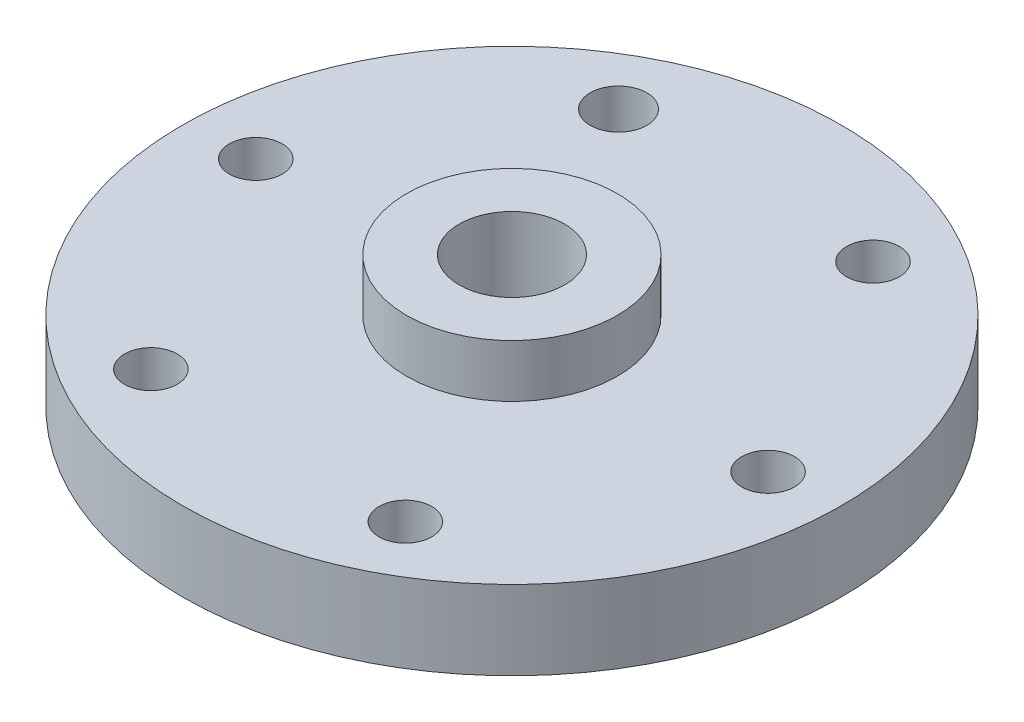
ISO-10303-21;
HEADER;
FILE_DESCRIPTION(('STEP AP214'),'2;1');
FILE_NAME('part.step','',(''),(''),'','','');
FILE_SCHEMA(('AUTOMOTIVE_DESIGN { 1 0 10303 214 1 1 1 1 }'));
ENDSEC;
DATA;
#1=APPLICATION_CONTEXT('core data for automotive mechanical design processes');
#2=APPLICATION_PROTOCOL_DEFINITION('international standard','automotive_design',2000,#1);
#3=PRODUCT_CONTEXT('',#1,'mechanical');
#4=PRODUCT('Part','Part','',(#3));
#5=PRODUCT_RELATED_PRODUCT_CATEGORY('part','',(#4));
#6=PRODUCT_DEFINITION_FORMATION('','',#4);
#7=PRODUCT_DEFINITION_CONTEXT('part definition',#1,'design');
#8=PRODUCT_DEFINITION('design','',#6,#7);
#9=PRODUCT_DEFINITION_SHAPE('','',#8);
#10=(LENGTH_UNIT() NAMED_UNIT(*) SI_UNIT(.MILLI.,.METRE.));
#11=(NAMED_UNIT(*) PLANE_ANGLE_UNIT() SI_UNIT($,.RADIAN.));
#12=(NAMED_UNIT(*) SI_UNIT($,.STERADIAN.) SOLID_ANGLE_UNIT());
#13=UNCERTAINTY_MEASURE_WITH_UNIT(LENGTH_MEASURE(1.E-05),#10,'distance_accuracy_value','');
#14=(GEOMETRIC_REPRESENTATION_CONTEXT(3) GLOBAL_UNCERTAINTY_ASSIGNED_CONTEXT((#13)) GLOBAL_UNIT_ASSIGNED_CONTEXT((#10,
#11,#12)) REPRESENTATION_CONTEXT('',''));
#15=CARTESIAN_POINT('',(0.,0.,0.));
#16=DIRECTION('',(0.,0.,1.));
#17=DIRECTION('',(1.,0.,0.));
#18=AXIS2_PLACEMENT_3D('',#15,#16,#17);
#19=CARTESIAN_POINT('',(0.,3.,0.));
#20=DIRECTION('',(0.,-1.,0.));
#21=DIRECTION('',(0.,0.,-1.));
#22=AXIS2_PLACEMENT_3D('',#19,#20,#21);
#23=CYLINDRICAL_SURFACE('',#22,12.5);
#24=CARTESIAN_POINT('',(0.,3.,0.));
#25=DIRECTION('',(0.,1.,0.));
#26=DIRECTION('',(0.,0.,1.));
#27=AXIS2_PLACEMENT_3D('',#24,#25,#26);
#28=CIRCLE('',#27,12.5);
#29=CARTESIAN_POINT('',(0.,3.,12.5));
#30=VERTEX_POINT('',#29);
#31=EDGE_CURVE('E10',#30,#30,#28,.T.);
#32=ORIENTED_EDGE('',*,*,#31,.F.);
#33=EDGE_LOOP('',(#32));
#34=FACE_BOUND('',#33,.T.);
#35=CARTESIAN_POINT('',(0.,0.,0.));
#36=DIRECTION('',(0.,1.,0.));
#37=DIRECTION('',(0.,0.,1.));
#38=AXIS2_PLACEMENT_3D('',#35,#36,#37);
#39=CIRCLE('',#38,12.5);
#40=CARTESIAN_POINT('',(0.,0.,12.5));
#41=VERTEX_POINT('',#40);
#42=EDGE_CURVE('E41',#41,#41,#39,.T.);
#43=ORIENTED_EDGE('',*,*,#42,.T.);
#44=EDGE_LOOP('',(#43));
#45=FACE_BOUND('',#44,.T.);
#46=ADVANCED_FACE('F34',(#34,#45),#23,.T.);
#47=CARTESIAN_POINT('',(0.,3.,0.));
#48=DIRECTION('',(0.,1.,0.));
#49=DIRECTION('',(0.,0.,1.));
#50=AXIS2_PLACEMENT_3D('',#47,#48,#49);
#51=PLANE('',#50);
#52=CARTESIAN_POINT('',(4.75488129081184,3.,8.79722137440491));
#53=DIRECTION('',(0.,1.,0.));
#54=DIRECTION('',(0.,0.,1.));
#55=AXIS2_PLACEMENT_3D('',#52,#53,#54);
#56=CIRCLE('',#55,1.);
#57=CARTESIAN_POINT('',(4.75488129081184,3.,9.7972213744049));
#58=VERTEX_POINT('',#57);
#59=EDGE_CURVE('E87',#58,#58,#56,.T.);
#60=ORIENTED_EDGE('',*,*,#59,.F.);
#61=EDGE_LOOP('',(#60));
#62=FACE_BOUND('',#61,.T.);
#63=CARTESIAN_POINT('',(9.99605783835602,3.,0.280762697380048));
#64=DIRECTION('',(0.,1.,0.));
#65=DIRECTION('',(0.,0.,1.));
#66=AXIS2_PLACEMENT_3D('',#63,#64,#65);
#67=CIRCLE('',#66,1.);
#68=CARTESIAN_POINT('',(9.99605783835602,3.,1.28076269738005));
#69=VERTEX_POINT('',#68);
#70=EDGE_CURVE('E84',#69,#69,#67,.T.);
#71=ORIENTED_EDGE('',*,*,#70,.F.);
#72=EDGE_LOOP('',(#71));
#73=FACE_BOUND('',#72,.T.);
#74=CARTESIAN_POINT('',(-4.75488129081184,3.,-8.79722137440491));
#75=DIRECTION('',(0.,1.,0.));
#76=DIRECTION('',(0.,0.,1.));
#77=AXIS2_PLACEMENT_3D('',#74,#75,#76);
#78=CIRCLE('',#77,1.07309001430205);
#79=CARTESIAN_POINT('',(-4.75488129081184,3.,-7.72413136010286));
#80=VERTEX_POINT('',#79);
#81=EDGE_CURVE('E78',#80,#80,#78,.T.);
#82=ORIENTED_EDGE('',*,*,#81,.F.);
#83=EDGE_LOOP('',(#82));
#84=FACE_BOUND('',#83,.T.);
#85=CARTESIAN_POINT('',(-9.99605783835603,3.,-0.280762697380052));
#86=DIRECTION('',(0.,1.,0.));
#87=DIRECTION('',(0.,0.,1.));
#88=AXIS2_PLACEMENT_3D('',#85,#86,#87);
#89=CIRCLE('',#88,1.);
#90=CARTESIAN_POINT('',(-9.99605783835603,3.,0.719237302619948));
#91=VERTEX_POINT('',#90);
#92=EDGE_CURVE('E72',#91,#91,#89,.T.);
#93=ORIENTED_EDGE('',*,*,#92,.F.);
#94=EDGE_LOOP('',(#93));
#95=FACE_BOUND('',#94,.T.);
#96=CARTESIAN_POINT('',(-5.08077042909345,3.,8.61334579076777));
#97=DIRECTION('',(0.,1.,0.));
#98=DIRECTION('',(0.,0.,1.));
#99=AXIS2_PLACEMENT_3D('',#96,#97,#98);
#100=CIRCLE('',#99,1.);
#101=CARTESIAN_POINT('',(-5.08077042909345,3.,9.61334579076777));
#102=VERTEX_POINT('',#101);
#103=EDGE_CURVE('E62',#102,#102,#100,.T.);
#104=ORIENTED_EDGE('',*,*,#103,.F.);
#105=EDGE_LOOP('',(#104));
#106=FACE_BOUND('',#105,.T.);
#107=CARTESIAN_POINT('',(5.08077042909345,3.,-8.61334579076778));
#108=DIRECTION('',(0.,1.,0.));
#109=DIRECTION('',(0.,0.,1.));
#110=AXIS2_PLACEMENT_3D('',#107,#108,#109);
#111=CIRCLE('',#110,1.00000000000076);
#112=CARTESIAN_POINT('',(5.08077042909345,3.,-7.61334579076701));
#113=VERTEX_POINT('',#112);
#114=EDGE_CURVE('E59',#113,#113,#111,.T.);
#115=ORIENTED_EDGE('',*,*,#114,.F.);
#116=EDGE_LOOP('',(#115));
#117=FACE_BOUND('',#116,.T.);
#118=CARTESIAN_POINT('',(0.,3.,0.));
#119=DIRECTION('',(0.,1.,0.));
#120=DIRECTION('',(0.,0.,1.));
#121=AXIS2_PLACEMENT_3D('',#118,#119,#120);
#122=CIRCLE('',#121,4.);
#123=CARTESIAN_POINT('',(0.,3.,4.));
#124=VERTEX_POINT('',#123);
#125=EDGE_CURVE('E46',#124,#124,#122,.F.);
#126=ORIENTED_EDGE('',*,*,#125,.T.);
#127=EDGE_LOOP('',(#126));
#128=FACE_BOUND('',#127,.T.);
#129=ORIENTED_EDGE('',*,*,#31,.T.);
#130=EDGE_LOOP('',(#129));
#131=FACE_BOUND('',#130,.T.);
#132=ADVANCED_FACE('F103',(#62,#73,#84,#95,#106,#117,#128,#131),#51,.T.);
#133=CARTESIAN_POINT('',(0.,0.,0.));
#134=DIRECTION('',(0.,1.,0.));
#135=DIRECTION('',(0.,0.,1.));
#136=AXIS2_PLACEMENT_3D('',#133,#134,#135);
#137=PLANE('',#136);
#138=CARTESIAN_POINT('',(4.75488129081184,0.,8.79722137440491));
#139=DIRECTION('',(0.,1.,0.));
#140=DIRECTION('',(0.,0.,1.));
#141=AXIS2_PLACEMENT_3D('',#138,#139,#140);
#142=CIRCLE('',#141,1.);
#143=CARTESIAN_POINT('',(4.75488129081184,0.,9.7972213744049));
#144=VERTEX_POINT('',#143);
#145=EDGE_CURVE('E66',#144,#144,#142,.T.);
#146=ORIENTED_EDGE('',*,*,#145,.T.);
#147=EDGE_LOOP('',(#146));
#148=FACE_BOUND('',#147,.T.);
#149=CARTESIAN_POINT('',(9.99605783835602,0.,0.280762697380048));
#150=DIRECTION('',(0.,1.,0.));
#151=DIRECTION('',(0.,0.,1.));
#152=AXIS2_PLACEMENT_3D('',#149,#150,#151);
#153=CIRCLE('',#152,1.);
#154=CARTESIAN_POINT('',(9.99605783835602,0.,1.28076269738005));
#155=VERTEX_POINT('',#154);
#156=EDGE_CURVE('E81',#155,#155,#153,.T.);
#157=ORIENTED_EDGE('',*,*,#156,.T.);
#158=EDGE_LOOP('',(#157));
#159=FACE_BOUND('',#158,.T.);
#160=CARTESIAN_POINT('',(-4.75488129081184,0.,-8.79722137440491));
#161=DIRECTION('',(0.,1.,0.));
#162=DIRECTION('',(0.,0.,1.));
#163=AXIS2_PLACEMENT_3D('',#160,#161,#162);
#164=CIRCLE('',#163,1.07309001430205);
#165=CARTESIAN_POINT('',(-4.75488129081184,0.,-7.72413136010286));
#166=VERTEX_POINT('',#165);
#167=EDGE_CURVE('E75',#166,#166,#164,.T.);
#168=ORIENTED_EDGE('',*,*,#167,.T.);
#169=EDGE_LOOP('',(#168));
#170=FACE_BOUND('',#169,.T.);
#171=CARTESIAN_POINT('',(-9.99605783835603,0.,-0.280762697380052));
#172=DIRECTION('',(0.,1.,0.));
#173=DIRECTION('',(0.,0.,1.));
#174=AXIS2_PLACEMENT_3D('',#171,#172,#173);
#175=CIRCLE('',#174,1.);
#176=CARTESIAN_POINT('',(-9.99605783835603,0.,0.719237302619948));
#177=VERTEX_POINT('',#176);
#178=EDGE_CURVE('E69',#177,#177,#175,.T.);
#179=ORIENTED_EDGE('',*,*,#178,.T.);
#180=EDGE_LOOP('',(#179));
#181=FACE_BOUND('',#180,.T.);
#182=CARTESIAN_POINT('',(-5.08077042909345,0.,8.61334579076777));
#183=DIRECTION('',(0.,1.,0.));
#184=DIRECTION('',(0.,0.,1.));
#185=AXIS2_PLACEMENT_3D('',#182,#183,#184);
#186=CIRCLE('',#185,1.);
#187=CARTESIAN_POINT('',(-5.08077042909345,0.,9.61334579076777));
#188=VERTEX_POINT('',#187);
#189=EDGE_CURVE('E63',#188,#188,#186,.T.);
#190=ORIENTED_EDGE('',*,*,#189,.T.);
#191=EDGE_LOOP('',(#190));
#192=FACE_BOUND('',#191,.T.);
#193=CARTESIAN_POINT('',(5.08077042909345,0.,-8.61334579076778));
#194=DIRECTION('',(0.,1.,0.));
#195=DIRECTION('',(0.,0.,1.));
#196=AXIS2_PLACEMENT_3D('',#193,#194,#195);
#197=CIRCLE('',#196,1.00000000000076);
#198=CARTESIAN_POINT('',(5.08077042909345,0.,-7.61334579076701));
#199=VERTEX_POINT('',#198);
#200=EDGE_CURVE('E37',#199,#199,#197,.T.);
#201=ORIENTED_EDGE('',*,*,#200,.T.);
#202=EDGE_LOOP('',(#201));
#203=FACE_BOUND('',#202,.T.);
#204=CARTESIAN_POINT('',(0.,0.,0.));
#205=DIRECTION('',(0.,1.,0.));
#206=DIRECTION('',(0.,0.,1.));
#207=AXIS2_PLACEMENT_3D('',#204,#205,#206);
#208=CIRCLE('',#207,2.);
#209=CARTESIAN_POINT('',(0.,0.,2.));
#210=VERTEX_POINT('',#209);
#211=EDGE_CURVE('E53',#210,#210,#208,.T.);
#212=ORIENTED_EDGE('',*,*,#211,.T.);
#213=EDGE_LOOP('',(#212));
#214=FACE_BOUND('',#213,.T.);
#215=ORIENTED_EDGE('',*,*,#42,.F.);
#216=EDGE_LOOP('',(#215));
#217=FACE_BOUND('',#216,.T.);
#218=ADVANCED_FACE('F93',(#148,#159,#170,#181,#192,#203,#214,#217),#137,.F.);
#219=CARTESIAN_POINT('',(0.,5.,0.));
#220=DIRECTION('',(0.,-1.,0.));
#221=DIRECTION('',(0.,0.,-1.));
#222=AXIS2_PLACEMENT_3D('',#219,#220,#221);
#223=CYLINDRICAL_SURFACE('',#222,4.);
#224=ORIENTED_EDGE('',*,*,#125,.F.);
#225=EDGE_LOOP('',(#224));
#226=FACE_BOUND('',#225,.T.);
#227=CARTESIAN_POINT('',(0.,5.,0.));
#228=DIRECTION('',(0.,1.,0.));
#229=DIRECTION('',(0.,0.,1.));
#230=AXIS2_PLACEMENT_3D('',#227,#228,#229);
#231=CIRCLE('',#230,4.);
#232=CARTESIAN_POINT('',(0.,5.,4.));
#233=VERTEX_POINT('',#232);
#234=EDGE_CURVE('E50',#233,#233,#231,.T.);
#235=ORIENTED_EDGE('',*,*,#234,.F.);
#236=EDGE_LOOP('',(#235));
#237=FACE_BOUND('',#236,.T.);
#238=ADVANCED_FACE('F119',(#226,#237),#223,.T.);
#239=CARTESIAN_POINT('',(0.,5.,0.));
#240=DIRECTION('',(0.,1.,0.));
#241=DIRECTION('',(0.,0.,1.));
#242=AXIS2_PLACEMENT_3D('',#239,#240,#241);
#243=PLANE('',#242);
#244=CARTESIAN_POINT('',(0.,5.,0.));
#245=DIRECTION('',(0.,1.,0.));
#246=DIRECTION('',(0.,0.,1.));
#247=AXIS2_PLACEMENT_3D('',#244,#245,#246);
#248=CIRCLE('',#247,2.);
#249=CARTESIAN_POINT('',(0.,5.,2.));
#250=VERTEX_POINT('',#249);
#251=EDGE_CURVE('E56',#250,#250,#248,.T.);
#252=ORIENTED_EDGE('',*,*,#251,.F.);
#253=EDGE_LOOP('',(#252));
#254=FACE_BOUND('',#253,.T.);
#255=ORIENTED_EDGE('',*,*,#234,.T.);
#256=EDGE_LOOP('',(#255));
#257=FACE_BOUND('',#256,.T.);
#258=ADVANCED_FACE('F122',(#254,#257),#243,.T.);
#259=CARTESIAN_POINT('',(0.,-3.,0.));
#260=DIRECTION('',(0.,1.,0.));
#261=DIRECTION('',(0.,0.,1.));
#262=AXIS2_PLACEMENT_3D('',#259,#260,#261);
#263=CYLINDRICAL_SURFACE('',#262,2.);
#264=ORIENTED_EDGE('',*,*,#251,.T.);
#265=EDGE_LOOP('',(#264));
#266=FACE_BOUND('',#265,.T.);
#267=ORIENTED_EDGE('',*,*,#211,.F.);
#268=EDGE_LOOP('',(#267));
#269=FACE_BOUND('',#268,.T.);
#270=ADVANCED_FACE('F127',(#266,#269),#263,.F.);
#271=CARTESIAN_POINT('',(5.08077042909345,-5.,-8.61334579076778));
#272=DIRECTION('',(0.,1.,0.));
#273=DIRECTION('',(0.,0.,1.));
#274=AXIS2_PLACEMENT_3D('',#271,#272,#273);
#275=CYLINDRICAL_SURFACE('',#274,1.00000000000076);
#276=ORIENTED_EDGE('',*,*,#114,.T.);
#277=EDGE_LOOP('',(#276));
#278=FACE_BOUND('',#277,.T.);
#279=ORIENTED_EDGE('',*,*,#200,.F.);
#280=EDGE_LOOP('',(#279));
#281=FACE_BOUND('',#280,.T.);
#282=ADVANCED_FACE('F133',(#278,#281),#275,.F.);
#283=CARTESIAN_POINT('',(-5.08077042909345,3.,8.61334579076777));
#284=DIRECTION('',(0.,-1.,0.));
#285=DIRECTION('',(0.,0.,-1.));
#286=AXIS2_PLACEMENT_3D('',#283,#284,#285);
#287=CYLINDRICAL_SURFACE('',#286,1.);
#288=ORIENTED_EDGE('',*,*,#103,.T.);
#289=EDGE_LOOP('',(#288));
#290=FACE_BOUND('',#289,.T.);
#291=ORIENTED_EDGE('',*,*,#189,.F.);
#292=EDGE_LOOP('',(#291));
#293=FACE_BOUND('',#292,.T.);
#294=ADVANCED_FACE('F175',(#290,#293),#287,.F.);
#295=CARTESIAN_POINT('',(-9.99605783835603,0.,-0.280762697380052));
#296=DIRECTION('',(0.,1.,0.));
#297=DIRECTION('',(0.,0.,1.));
#298=AXIS2_PLACEMENT_3D('',#295,#296,#297);
#299=CYLINDRICAL_SURFACE('',#298,1.);
#300=ORIENTED_EDGE('',*,*,#178,.F.);
#301=EDGE_LOOP('',(#300));
#302=FACE_BOUND('',#301,.T.);
#303=ORIENTED_EDGE('',*,*,#92,.T.);
#304=EDGE_LOOP('',(#303));
#305=FACE_BOUND('',#304,.T.);
#306=ADVANCED_FACE('F184',(#302,#305),#299,.F.);
#307=CARTESIAN_POINT('',(-4.75488129081184,0.,-8.79722137440491));
#308=DIRECTION('',(0.,1.,0.));
#309=DIRECTION('',(0.,0.,1.));
#310=AXIS2_PLACEMENT_3D('',#307,#308,#309);
#311=CYLINDRICAL_SURFACE('',#310,1.07309001430205);
#312=ORIENTED_EDGE('',*,*,#167,.F.);
#313=EDGE_LOOP('',(#312));
#314=FACE_BOUND('',#313,.T.);
#315=ORIENTED_EDGE('',*,*,#81,.T.);
#316=EDGE_LOOP('',(#315));
#317=FACE_BOUND('',#316,.T.);
#318=ADVANCED_FACE('F202',(#314,#317),#311,.F.);
#319=CARTESIAN_POINT('',(9.99605783835602,0.,0.280762697380048));
#320=DIRECTION('',(0.,1.,0.));
#321=DIRECTION('',(0.,0.,1.));
#322=AXIS2_PLACEMENT_3D('',#319,#320,#321);
#323=CYLINDRICAL_SURFACE('',#322,1.);
#324=ORIENTED_EDGE('',*,*,#156,.F.);
#325=EDGE_LOOP('',(#324));
#326=FACE_BOUND('',#325,.T.);
#327=ORIENTED_EDGE('',*,*,#70,.T.);
#328=EDGE_LOOP('',(#327));
#329=FACE_BOUND('',#328,.T.);
#330=ADVANCED_FACE('F99',(#326,#329),#323,.F.);
#331=CARTESIAN_POINT('',(4.75488129081184,0.,8.79722137440491));
#332=DIRECTION('',(0.,1.,0.));
#333=DIRECTION('',(0.,0.,1.));
#334=AXIS2_PLACEMENT_3D('',#331,#332,#333);
#335=CYLINDRICAL_SURFACE('',#334,1.);
#336=ORIENTED_EDGE('',*,*,#145,.F.);
#337=EDGE_LOOP('',(#336));
#338=FACE_BOUND('',#337,.T.);
#339=ORIENTED_EDGE('',*,*,#59,.T.);
#340=EDGE_LOOP('',(#339));
#341=FACE_BOUND('',#340,.T.);
#342=ADVANCED_FACE('F96',(#338,#341),#335,.F.);
#343=CLOSED_SHELL('',(#46,#132,#218,#238,#258,#270,#282,#294,#306,#318,#330,#342));
#344=MANIFOLD_SOLID_BREP('B2',#343);
#345=ADVANCED_BREP_SHAPE_REPRESENTATION('',(#18,#344),#14);
#346=SHAPE_DEFINITION_REPRESENTATION(#9,#345);
ENDSEC;
END-ISO-10303-21;
